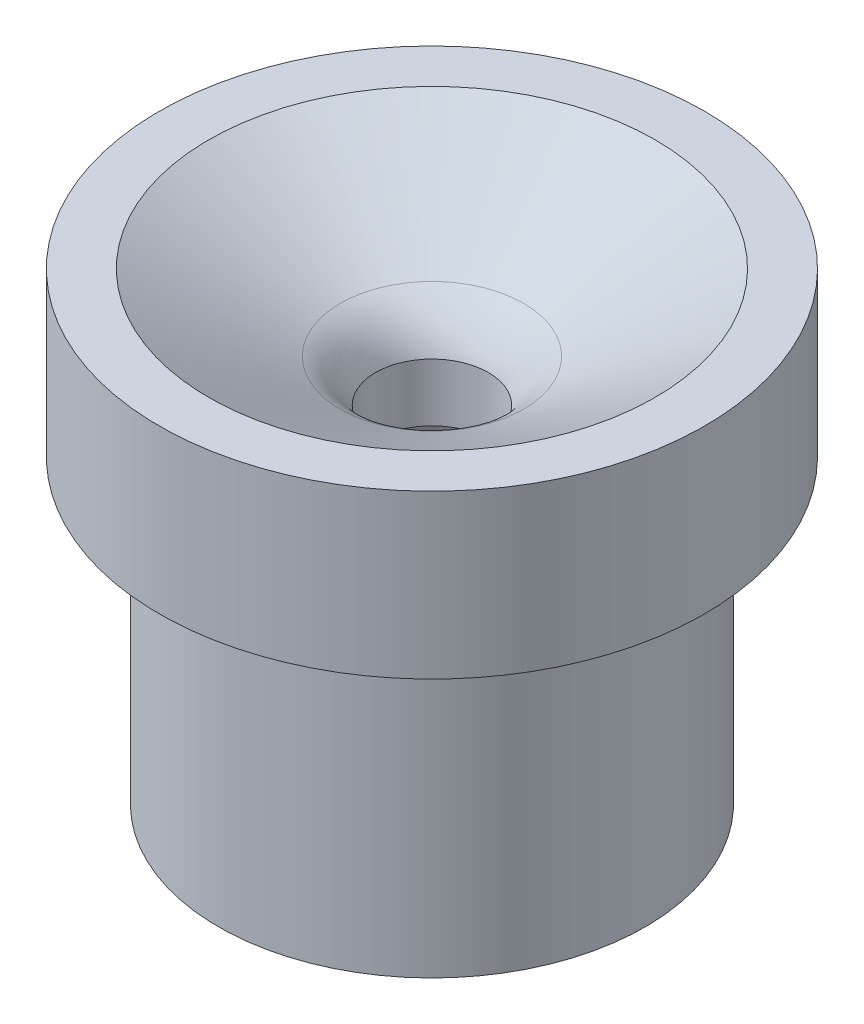
ISO-10303-21;
HEADER;
FILE_DESCRIPTION(('STEP AP214'),'2;1');
FILE_NAME('part.step','',(''),(''),'','','');
FILE_SCHEMA(('AUTOMOTIVE_DESIGN { 1 0 10303 214 1 1 1 1 }'));
ENDSEC;
DATA;
#1=APPLICATION_CONTEXT('core data for automotive mechanical design processes');
#2=APPLICATION_PROTOCOL_DEFINITION('international standard','automotive_design',2000,#1);
#3=PRODUCT_CONTEXT('',#1,'mechanical');
#4=PRODUCT('Part','Part','',(#3));
#5=PRODUCT_RELATED_PRODUCT_CATEGORY('part','',(#4));
#6=PRODUCT_DEFINITION_FORMATION('','',#4);
#7=PRODUCT_DEFINITION_CONTEXT('part definition',#1,'design');
#8=PRODUCT_DEFINITION('design','',#6,#7);
#9=PRODUCT_DEFINITION_SHAPE('','',#8);
#10=(LENGTH_UNIT() NAMED_UNIT(*) SI_UNIT(.MILLI.,.METRE.));
#11=(NAMED_UNIT(*) PLANE_ANGLE_UNIT() SI_UNIT($,.RADIAN.));
#12=(NAMED_UNIT(*) SI_UNIT($,.STERADIAN.) SOLID_ANGLE_UNIT());
#13=UNCERTAINTY_MEASURE_WITH_UNIT(LENGTH_MEASURE(1.E-05),#10,'distance_accuracy_value','');
#14=(GEOMETRIC_REPRESENTATION_CONTEXT(3) GLOBAL_UNCERTAINTY_ASSIGNED_CONTEXT((#13)) GLOBAL_UNIT_ASSIGNED_CONTEXT((#10,
#11,#12)) REPRESENTATION_CONTEXT('',''));
#15=CARTESIAN_POINT('',(0.,0.,0.));
#16=DIRECTION('',(0.,0.,1.));
#17=DIRECTION('',(1.,0.,0.));
#18=AXIS2_PLACEMENT_3D('',#15,#16,#17);
#19=CARTESIAN_POINT('',(0.,-36.3347,0.));
#20=DIRECTION('',(0.,-1.,0.));
#21=DIRECTION('',(0.,0.,-1.));
#22=AXIS2_PLACEMENT_3D('',#19,#20,#21);
#23=CONICAL_SURFACE('',#22,15.8953535222269,0.261799387799143);
#24=CARTESIAN_POINT('',(0.,-2.08546999126955,0.));
#25=DIRECTION('',(0.,-1.,0.));
#26=DIRECTION('',(0.,0.,-1.));
#27=AXIS2_PLACEMENT_3D('',#24,#25,#26);
#28=CIRCLE('',#27,6.7183);
#29=CARTESIAN_POINT('',(0.,-2.08546999126955,-6.7183));
#30=VERTEX_POINT('',#29);
#31=EDGE_CURVE('E79',#30,#30,#28,.F.);
#32=ORIENTED_EDGE('',*,*,#31,.T.);
#33=EDGE_LOOP('',(#32));
#34=FACE_BOUND('',#33,.T.);
#35=CARTESIAN_POINT('',(0.,-36.3347,0.));
#36=DIRECTION('',(0.,-1.,0.));
#37=DIRECTION('',(0.,0.,-1.));
#38=AXIS2_PLACEMENT_3D('',#35,#36,#37);
#39=CIRCLE('',#38,15.8953535222269);
#40=CARTESIAN_POINT('',(0.,-36.3347,-15.8953535222269));
#41=VERTEX_POINT('',#40);
#42=EDGE_CURVE('E10',#41,#41,#39,.T.);
#43=ORIENTED_EDGE('',*,*,#42,.T.);
#44=EDGE_LOOP('',(#43));
#45=FACE_BOUND('',#44,.T.);
#46=ADVANCED_FACE('F43',(#34,#45),#23,.F.);
#47=CARTESIAN_POINT('',(-15.8953535222269,-36.3347,0.));
#48=DIRECTION('',(0.,1.,0.));
#49=DIRECTION('',(0.,0.,1.));
#50=AXIS2_PLACEMENT_3D('',#47,#48,#49);
#51=PLANE('',#50);
#52=ORIENTED_EDGE('',*,*,#42,.F.);
#53=EDGE_LOOP('',(#52));
#54=FACE_BOUND('',#53,.T.);
#55=CARTESIAN_POINT('',(0.,-36.3347,0.));
#56=DIRECTION('',(0.,-1.,0.));
#57=DIRECTION('',(0.,0.,-1.));
#58=AXIS2_PLACEMENT_3D('',#55,#56,#57);
#59=CIRCLE('',#58,25.4);
#60=CARTESIAN_POINT('',(0.,-36.3347,-25.4));
#61=VERTEX_POINT('',#60);
#62=EDGE_CURVE('E51',#61,#61,#59,.T.);
#63=ORIENTED_EDGE('',*,*,#62,.T.);
#64=EDGE_LOOP('',(#63));
#65=FACE_BOUND('',#64,.T.);
#66=ADVANCED_FACE('F103',(#54,#65),#51,.F.);
#67=CARTESIAN_POINT('',(0.,0.,0.));
#68=DIRECTION('',(0.,-1.,0.));
#69=DIRECTION('',(0.,0.,-1.));
#70=AXIS2_PLACEMENT_3D('',#67,#68,#69);
#71=CYLINDRICAL_SURFACE('',#70,25.4);
#72=ORIENTED_EDGE('',*,*,#62,.F.);
#73=EDGE_LOOP('',(#72));
#74=FACE_BOUND('',#73,.T.);
#75=CARTESIAN_POINT('',(0.,-0.503022428685855,0.));
#76=DIRECTION('',(0.,-1.,0.));
#77=DIRECTION('',(0.,0.,-1.));
#78=AXIS2_PLACEMENT_3D('',#75,#76,#77);
#79=CIRCLE('',#78,25.4);
#80=CARTESIAN_POINT('',(0.,-0.503022428685855,-25.4));
#81=VERTEX_POINT('',#80);
#82=EDGE_CURVE('E57',#81,#81,#79,.T.);
#83=ORIENTED_EDGE('',*,*,#82,.T.);
#84=EDGE_LOOP('',(#83));
#85=FACE_BOUND('',#84,.T.);
#86=ADVANCED_FACE('F108',(#74,#85),#71,.T.);
#87=CARTESIAN_POINT('',(-25.4,-0.503022428685856,0.));
#88=DIRECTION('',(0.,1.,0.));
#89=DIRECTION('',(0.,0.,1.));
#90=AXIS2_PLACEMENT_3D('',#87,#88,#89);
#91=PLANE('',#90);
#92=ORIENTED_EDGE('',*,*,#82,.F.);
#93=EDGE_LOOP('',(#92));
#94=FACE_BOUND('',#93,.T.);
#95=CARTESIAN_POINT('',(0.,-0.503022428685856,0.));
#96=DIRECTION('',(0.,-1.,0.));
#97=DIRECTION('',(0.,0.,-1.));
#98=AXIS2_PLACEMENT_3D('',#95,#96,#97);
#99=CIRCLE('',#98,32.4739);
#100=CARTESIAN_POINT('',(0.,-0.503022428685856,-32.4739));
#101=VERTEX_POINT('',#100);
#102=EDGE_CURVE('E63',#101,#101,#99,.T.);
#103=ORIENTED_EDGE('',*,*,#102,.T.);
#104=EDGE_LOOP('',(#103));
#105=FACE_BOUND('',#104,.T.);
#106=ADVANCED_FACE('F113',(#94,#105),#91,.F.);
#107=CARTESIAN_POINT('',(0.,0.,0.));
#108=DIRECTION('',(0.,-1.,0.));
#109=DIRECTION('',(0.,0.,-1.));
#110=AXIS2_PLACEMENT_3D('',#107,#108,#109);
#111=CYLINDRICAL_SURFACE('',#110,32.4739);
#112=ORIENTED_EDGE('',*,*,#102,.F.);
#113=EDGE_LOOP('',(#112));
#114=FACE_BOUND('',#113,.T.);
#115=CARTESIAN_POINT('',(0.,18.8771775713141,0.));
#116=DIRECTION('',(0.,-1.,0.));
#117=DIRECTION('',(0.,0.,-1.));
#118=AXIS2_PLACEMENT_3D('',#115,#116,#117);
#119=CIRCLE('',#118,32.4739);
#120=CARTESIAN_POINT('',(0.,18.8771775713141,-32.4739));
#121=VERTEX_POINT('',#120);
#122=EDGE_CURVE('E67',#121,#121,#119,.T.);
#123=ORIENTED_EDGE('',*,*,#122,.T.);
#124=EDGE_LOOP('',(#123));
#125=FACE_BOUND('',#124,.T.);
#126=ADVANCED_FACE('F120',(#114,#125),#111,.T.);
#127=CARTESIAN_POINT('',(-32.4739,18.8771775713141,0.));
#128=DIRECTION('',(0.,-1.,0.));
#129=DIRECTION('',(0.,0.,-1.));
#130=AXIS2_PLACEMENT_3D('',#127,#128,#129);
#131=PLANE('',#130);
#132=ORIENTED_EDGE('',*,*,#122,.F.);
#133=EDGE_LOOP('',(#132));
#134=FACE_BOUND('',#133,.T.);
#135=CARTESIAN_POINT('',(0.,18.8771775713141,0.));
#136=DIRECTION('',(0.,-1.,0.));
#137=DIRECTION('',(0.,0.,-1.));
#138=AXIS2_PLACEMENT_3D('',#135,#136,#137);
#139=CIRCLE('',#138,26.5811);
#140=CARTESIAN_POINT('',(0.,18.8771775713141,-26.5811));
#141=VERTEX_POINT('',#140);
#142=EDGE_CURVE('E71',#141,#141,#139,.T.);
#143=ORIENTED_EDGE('',*,*,#142,.T.);
#144=EDGE_LOOP('',(#143));
#145=FACE_BOUND('',#144,.T.);
#146=ADVANCED_FACE('F124',(#134,#145),#131,.F.);
#147=CARTESIAN_POINT('',(0.,9.83639197104676,0.));
#148=DIRECTION('',(0.,1.,0.));
#149=DIRECTION('',(0.,0.,1.));
#150=AXIS2_PLACEMENT_3D('',#147,#148,#149);
#151=CONICAL_SURFACE('',#150,10.922,1.04719755119659);
#152=ORIENTED_EDGE('',*,*,#142,.F.);
#153=EDGE_LOOP('',(#152));
#154=FACE_BOUND('',#153,.T.);
#155=CARTESIAN_POINT('',(0.,9.83639197104676,0.));
#156=DIRECTION('',(0.,-1.,0.));
#157=DIRECTION('',(0.,0.,-1.));
#158=AXIS2_PLACEMENT_3D('',#155,#156,#157);
#159=CIRCLE('',#158,10.922);
#160=CARTESIAN_POINT('',(0.,9.83639197104676,-10.922));
#161=VERTEX_POINT('',#160);
#162=EDGE_CURVE('E75',#161,#161,#159,.T.);
#163=ORIENTED_EDGE('',*,*,#162,.T.);
#164=EDGE_LOOP('',(#163));
#165=FACE_BOUND('',#164,.T.);
#166=ADVANCED_FACE('F100',(#154,#165),#151,.F.);
#167=CARTESIAN_POINT('',(0.,1.5875,0.));
#168=DIRECTION('',(0.,-1.,0.));
#169=DIRECTION('',(0.,0.,-1.));
#170=AXIS2_PLACEMENT_3D('',#167,#168,#169);
#171=TOROIDAL_SURFACE('',#170,15.6845,9.525);
#172=CARTESIAN_POINT('',(0.,4.80198013837385,0.));
#173=DIRECTION('',(0.,-1.,0.));
#174=DIRECTION('',(0.,0.,-1.));
#175=AXIS2_PLACEMENT_3D('',#172,#173,#174);
#176=CIRCLE('',#175,6.7183);
#177=CARTESIAN_POINT('',(0.,4.80198013837385,-6.7183));
#178=VERTEX_POINT('',#177);
#179=EDGE_CURVE('E46',#178,#178,#176,.T.);
#180=ORIENTED_EDGE('',*,*,#179,.T.);
#181=EDGE_LOOP('',(#180));
#182=FACE_BOUND('',#181,.T.);
#183=ORIENTED_EDGE('',*,*,#162,.F.);
#184=EDGE_LOOP('',(#183));
#185=FACE_BOUND('',#184,.T.);
#186=ADVANCED_FACE('F90',(#182,#185),#171,.T.);
#187=CARTESIAN_POINT('',(0.,-36.3347,0.));
#188=DIRECTION('',(0.,1.,0.));
#189=DIRECTION('',(0.,0.,1.));
#190=AXIS2_PLACEMENT_3D('',#187,#188,#189);
#191=CYLINDRICAL_SURFACE('',#190,6.7183);
#192=ORIENTED_EDGE('',*,*,#179,.F.);
#193=EDGE_LOOP('',(#192));
#194=FACE_BOUND('',#193,.T.);
#195=ORIENTED_EDGE('',*,*,#31,.F.);
#196=EDGE_LOOP('',(#195));
#197=FACE_BOUND('',#196,.T.);
#198=ADVANCED_FACE('F93',(#194,#197),#191,.F.);
#199=CLOSED_SHELL('',(#46,#66,#86,#106,#126,#146,#166,#186,#198));
#200=MANIFOLD_SOLID_BREP('B2',#199);
#201=ADVANCED_BREP_SHAPE_REPRESENTATION('',(#18,#200),#14);
#202=SHAPE_DEFINITION_REPRESENTATION(#9,#201);
ENDSEC;
END-ISO-10303-21;
